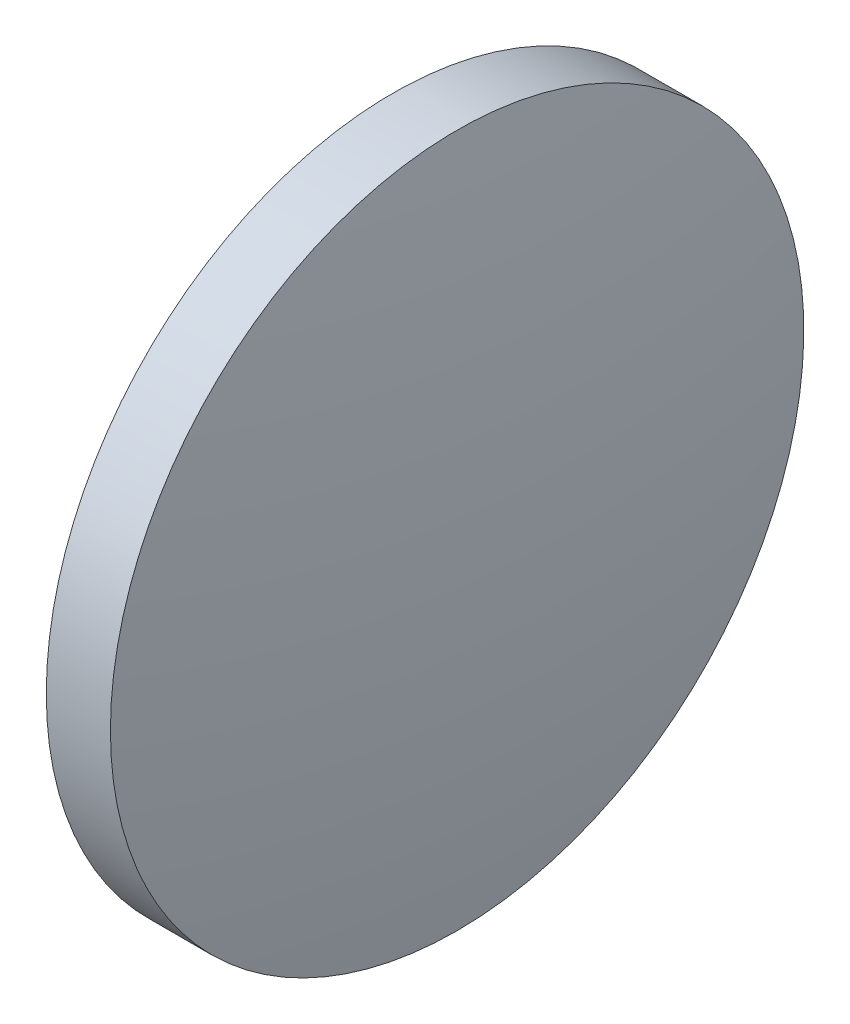
ISO-10303-21;
HEADER;
FILE_DESCRIPTION(('STEP AP214'),'2;1');
FILE_NAME('part.step','',(''),(''),'','','');
FILE_SCHEMA(('AUTOMOTIVE_DESIGN { 1 0 10303 214 1 1 1 1 }'));
ENDSEC;
DATA;
#1=APPLICATION_CONTEXT('core data for automotive mechanical design processes');
#2=APPLICATION_PROTOCOL_DEFINITION('international standard','automotive_design',2000,#1);
#3=PRODUCT_CONTEXT('',#1,'mechanical');
#4=PRODUCT('Part','Part','',(#3));
#5=PRODUCT_RELATED_PRODUCT_CATEGORY('part','',(#4));
#6=PRODUCT_DEFINITION_FORMATION('','',#4);
#7=PRODUCT_DEFINITION_CONTEXT('part definition',#1,'design');
#8=PRODUCT_DEFINITION('design','',#6,#7);
#9=PRODUCT_DEFINITION_SHAPE('','',#8);
#10=(LENGTH_UNIT() NAMED_UNIT(*) SI_UNIT(.MILLI.,.METRE.));
#11=(NAMED_UNIT(*) PLANE_ANGLE_UNIT() SI_UNIT($,.RADIAN.));
#12=(NAMED_UNIT(*) SI_UNIT($,.STERADIAN.) SOLID_ANGLE_UNIT());
#13=UNCERTAINTY_MEASURE_WITH_UNIT(LENGTH_MEASURE(1.E-05),#10,'distance_accuracy_value','');
#14=(GEOMETRIC_REPRESENTATION_CONTEXT(3) GLOBAL_UNCERTAINTY_ASSIGNED_CONTEXT((#13)) GLOBAL_UNIT_ASSIGNED_CONTEXT((#10,
#11,#12)) REPRESENTATION_CONTEXT('',''));
#15=CARTESIAN_POINT('',(0.,0.,0.));
#16=DIRECTION('',(0.,0.,1.));
#17=DIRECTION('',(1.,0.,0.));
#18=AXIS2_PLACEMENT_3D('',#15,#16,#17);
#19=CARTESIAN_POINT('',(381.137711179158,100.31169858817,0.));
#20=DIRECTION('',(-1.,0.,0.));
#21=DIRECTION('',(0.,-1.,0.));
#22=AXIS2_PLACEMENT_3D('',#19,#20,#21);
#23=SPHERICAL_SURFACE('',#22,51.9229032258065);
#24=CARTESIAN_POINT('',(432.440614404965,100.31169858817,0.));
#25=DIRECTION('',(-1.,0.,0.));
#26=DIRECTION('',(0.,0.,1.));
#27=AXIS2_PLACEMENT_3D('',#24,#25,#26);
#28=CIRCLE('',#27,8.00000000000001);
#29=CARTESIAN_POINT('',(432.440614404965,100.31169858817,8.00000000000001));
#30=VERTEX_POINT('',#29);
#31=EDGE_CURVE('E10',#30,#30,#28,.T.);
#32=ORIENTED_EDGE('',*,*,#31,.F.);
#33=EDGE_LOOP('',(#32));
#34=FACE_BOUND('',#33,.T.);
#35=ADVANCED_FACE('F35',(#34),#23,.T.);
#36=CARTESIAN_POINT('',(427.235345784603,100.31169858817,0.));
#37=DIRECTION('',(-1.,0.,0.));
#38=DIRECTION('',(0.,0.,1.));
#39=AXIS2_PLACEMENT_3D('',#36,#37,#38);
#40=CYLINDRICAL_SURFACE('',#39,8.00000000000001);
#41=CARTESIAN_POINT('',(430.960614404965,100.31169858817,0.));
#42=DIRECTION('',(-1.,0.,0.));
#43=DIRECTION('',(0.,0.,1.));
#44=AXIS2_PLACEMENT_3D('',#41,#42,#43);
#45=CIRCLE('',#44,8.00000000000001);
#46=CARTESIAN_POINT('',(430.960614404965,100.31169858817,8.00000000000001));
#47=VERTEX_POINT('',#46);
#48=EDGE_CURVE('E41',#47,#47,#45,.T.);
#49=ORIENTED_EDGE('',*,*,#48,.F.);
#50=EDGE_LOOP('',(#49));
#51=FACE_BOUND('',#50,.T.);
#52=ORIENTED_EDGE('',*,*,#31,.T.);
#53=EDGE_LOOP('',(#52));
#54=FACE_BOUND('',#53,.T.);
#55=ADVANCED_FACE('F49',(#51,#54),#40,.T.);
#56=CARTESIAN_POINT('',(430.960614404965,100.31169858817,0.));
#57=DIRECTION('',(1.,0.,0.));
#58=DIRECTION('',(0.,0.,-1.));
#59=AXIS2_PLACEMENT_3D('',#56,#57,#58);
#60=PLANE('',#59);
#61=ORIENTED_EDGE('',*,*,#48,.T.);
#62=EDGE_LOOP('',(#61));
#63=FACE_BOUND('',#62,.T.);
#64=ADVANCED_FACE('F47',(#63),#60,.F.);
#65=CLOSED_SHELL('',(#35,#55,#64));
#66=MANIFOLD_SOLID_BREP('B2',#65);
#67=ADVANCED_BREP_SHAPE_REPRESENTATION('',(#18,#66),#14);
#68=SHAPE_DEFINITION_REPRESENTATION(#9,#67);
ENDSEC;
END-ISO-10303-21;
